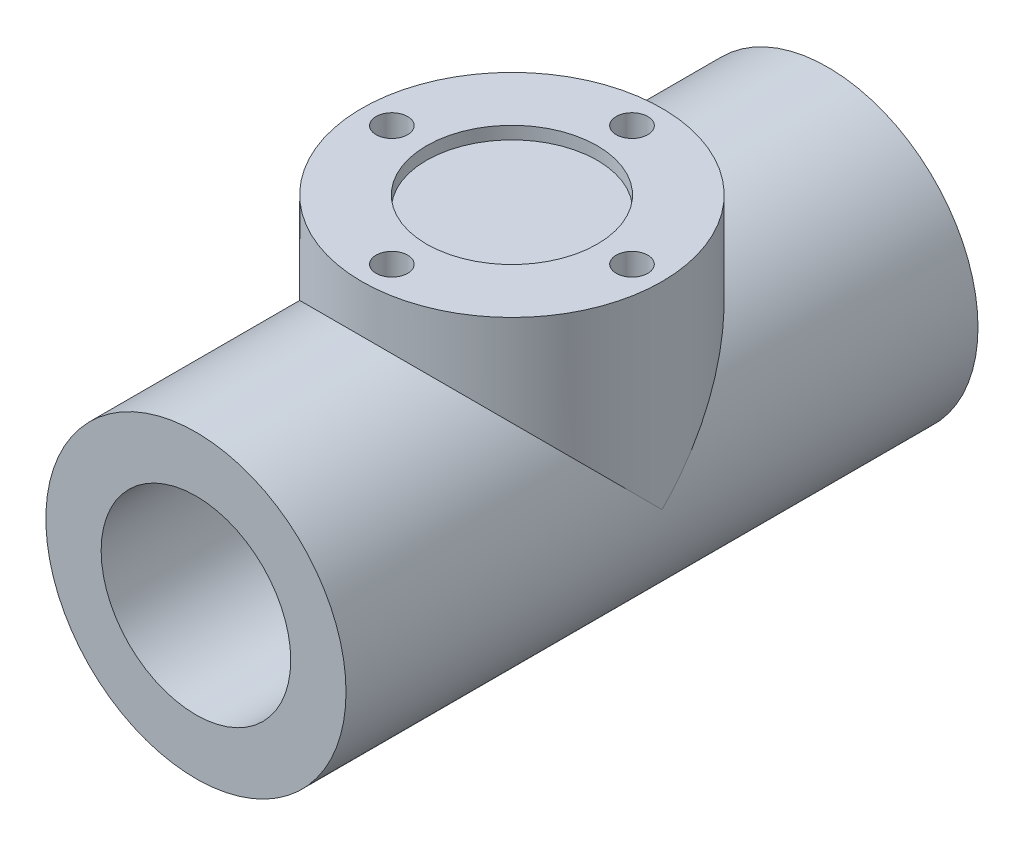
ISO-10303-21;
HEADER;
FILE_DESCRIPTION(('STEP AP214'),'2;1');
FILE_NAME('part.step','',(''),(''),'','','');
FILE_SCHEMA(('AUTOMOTIVE_DESIGN { 1 0 10303 214 1 1 1 1 }'));
ENDSEC;
DATA;
#1=APPLICATION_CONTEXT('core data for automotive mechanical design processes');
#2=APPLICATION_PROTOCOL_DEFINITION('international standard','automotive_design',2000,#1);
#3=PRODUCT_CONTEXT('',#1,'mechanical');
#4=PRODUCT('Part','Part','',(#3));
#5=PRODUCT_RELATED_PRODUCT_CATEGORY('part','',(#4));
#6=PRODUCT_DEFINITION_FORMATION('','',#4);
#7=PRODUCT_DEFINITION_CONTEXT('part definition',#1,'design');
#8=PRODUCT_DEFINITION('design','',#6,#7);
#9=PRODUCT_DEFINITION_SHAPE('','',#8);
#10=(LENGTH_UNIT() NAMED_UNIT(*) SI_UNIT(.MILLI.,.METRE.));
#11=(NAMED_UNIT(*) PLANE_ANGLE_UNIT() SI_UNIT($,.RADIAN.));
#12=(NAMED_UNIT(*) SI_UNIT($,.STERADIAN.) SOLID_ANGLE_UNIT());
#13=UNCERTAINTY_MEASURE_WITH_UNIT(LENGTH_MEASURE(1.E-05),#10,'distance_accuracy_value','');
#14=(GEOMETRIC_REPRESENTATION_CONTEXT(3) GLOBAL_UNCERTAINTY_ASSIGNED_CONTEXT((#13)) GLOBAL_UNIT_ASSIGNED_CONTEXT((#10,
#11,#12)) REPRESENTATION_CONTEXT('',''));
#15=CARTESIAN_POINT('',(0.,0.,0.));
#16=DIRECTION('',(0.,0.,1.));
#17=DIRECTION('',(1.,0.,0.));
#18=AXIS2_PLACEMENT_3D('',#15,#16,#17);
#19=CARTESIAN_POINT('',(0.,0.,100.));
#20=DIRECTION('',(0.,0.,-1.));
#21=DIRECTION('',(-1.,0.,0.));
#22=AXIS2_PLACEMENT_3D('',#19,#20,#21);
#23=CYLINDRICAL_SURFACE('',#22,47.5);
#24=CARTESIAN_POINT('',(0.,0.,-100.));
#25=DIRECTION('',(0.,0.,1.));
#26=DIRECTION('',(1.,0.,0.));
#27=AXIS2_PLACEMENT_3D('',#24,#25,#26);
#28=CIRCLE('',#27,47.5);
#29=CARTESIAN_POINT('',(47.5,0.,-100.));
#30=VERTEX_POINT('',#29);
#31=EDGE_CURVE('E53',#30,#30,#28,.T.);
#32=ORIENTED_EDGE('',*,*,#31,.T.);
#33=EDGE_LOOP('',(#32));
#34=FACE_BOUND('',#33,.T.);
#35=CARTESIAN_POINT('',(0.,0.,100.));
#36=DIRECTION('',(0.,0.,1.));
#37=DIRECTION('',(1.,0.,0.));
#38=AXIS2_PLACEMENT_3D('',#35,#36,#37);
#39=CIRCLE('',#38,47.5);
#40=CARTESIAN_POINT('',(47.5,0.,100.));
#41=VERTEX_POINT('',#40);
#42=EDGE_CURVE('E51',#41,#41,#39,.T.);
#43=ORIENTED_EDGE('',*,*,#42,.F.);
#44=EDGE_LOOP('',(#43));
#45=FACE_BOUND('',#44,.T.);
#46=CARTESIAN_POINT('',(0.,0.,0.));
#47=DIRECTION('',(0.,-0.707106781186547,-0.707106781186547));
#48=DIRECTION('',(0.,0.707106781186547,-0.707106781186547));
#49=AXIS2_PLACEMENT_3D('',#46,#47,#48);
#50=ELLIPSE('',#49,67.175144212722,47.5);
#51=CARTESIAN_POINT('',(47.5,0.,0.));
#52=VERTEX_POINT('',#51);
#53=CARTESIAN_POINT('',(-47.5,0.,0.));
#54=VERTEX_POINT('',#53);
#55=EDGE_CURVE('E11',#52,#54,#50,.F.);
#56=ORIENTED_EDGE('',*,*,#55,.F.);
#57=CARTESIAN_POINT('',(0.,0.,0.));
#58=DIRECTION('',(0.,0.707106781186547,-0.707106781186547));
#59=DIRECTION('',(0.,-0.707106781186547,-0.707106781186547));
#60=AXIS2_PLACEMENT_3D('',#57,#58,#59);
#61=ELLIPSE('',#60,67.175144212722,47.5);
#62=EDGE_CURVE('E43',#54,#52,#61,.T.);
#63=ORIENTED_EDGE('',*,*,#62,.F.);
#64=EDGE_LOOP('',(#56,#63));
#65=FACE_BOUND('',#64,.T.);
#66=ADVANCED_FACE('F36',(#34,#45,#65),#23,.T.);
#67=CARTESIAN_POINT('',(0.,0.,100.));
#68=DIRECTION('',(0.,0.,1.));
#69=DIRECTION('',(1.,0.,0.));
#70=AXIS2_PLACEMENT_3D('',#67,#68,#69);
#71=PLANE('',#70);
#72=CARTESIAN_POINT('',(0.,0.,100.));
#73=DIRECTION('',(0.,0.,1.));
#74=DIRECTION('',(1.,0.,0.));
#75=AXIS2_PLACEMENT_3D('',#72,#73,#74);
#76=CIRCLE('',#75,30.);
#77=CARTESIAN_POINT('',(30.,0.,100.));
#78=VERTEX_POINT('',#77);
#79=EDGE_CURVE('E91',#78,#78,#76,.F.);
#80=ORIENTED_EDGE('',*,*,#79,.T.);
#81=EDGE_LOOP('',(#80));
#82=FACE_BOUND('',#81,.T.);
#83=ORIENTED_EDGE('',*,*,#42,.T.);
#84=EDGE_LOOP('',(#83));
#85=FACE_BOUND('',#84,.T.);
#86=ADVANCED_FACE('F104',(#82,#85),#71,.T.);
#87=CARTESIAN_POINT('',(0.,0.,-100.));
#88=DIRECTION('',(0.,0.,1.));
#89=DIRECTION('',(1.,0.,0.));
#90=AXIS2_PLACEMENT_3D('',#87,#88,#89);
#91=PLANE('',#90);
#92=CARTESIAN_POINT('',(0.,0.,-100.));
#93=DIRECTION('',(0.,0.,-1.));
#94=DIRECTION('',(-1.,0.,0.));
#95=AXIS2_PLACEMENT_3D('',#92,#93,#94);
#96=CIRCLE('',#95,30.);
#97=CARTESIAN_POINT('',(-30.,0.,-100.));
#98=VERTEX_POINT('',#97);
#99=EDGE_CURVE('E94',#98,#98,#96,.T.);
#100=ORIENTED_EDGE('',*,*,#99,.F.);
#101=EDGE_LOOP('',(#100));
#102=FACE_BOUND('',#101,.T.);
#103=ORIENTED_EDGE('',*,*,#31,.F.);
#104=EDGE_LOOP('',(#103));
#105=FACE_BOUND('',#104,.T.);
#106=ADVANCED_FACE('F101',(#102,#105),#91,.F.);
#107=CARTESIAN_POINT('',(0.,62.5,0.));
#108=DIRECTION('',(0.,-1.,0.));
#109=DIRECTION('',(0.,0.,-1.));
#110=AXIS2_PLACEMENT_3D('',#107,#108,#109);
#111=CYLINDRICAL_SURFACE('',#110,47.5);
#112=CARTESIAN_POINT('',(0.,62.5,0.));
#113=DIRECTION('',(0.,1.,0.));
#114=DIRECTION('',(0.,0.,1.));
#115=AXIS2_PLACEMENT_3D('',#112,#113,#114);
#116=CIRCLE('',#115,47.5);
#117=CARTESIAN_POINT('',(0.,62.5,47.5));
#118=VERTEX_POINT('',#117);
#119=EDGE_CURVE('E57',#118,#118,#116,.T.);
#120=ORIENTED_EDGE('',*,*,#119,.F.);
#121=EDGE_LOOP('',(#120));
#122=FACE_BOUND('',#121,.T.);
#123=ORIENTED_EDGE('',*,*,#62,.T.);
#124=ORIENTED_EDGE('',*,*,#55,.T.);
#125=EDGE_LOOP('',(#123,#124));
#126=FACE_BOUND('',#125,.T.);
#127=ADVANCED_FACE('F50',(#122,#126),#111,.T.);
#128=CARTESIAN_POINT('',(0.,62.5,0.));
#129=DIRECTION('',(0.,1.,0.));
#130=DIRECTION('',(0.,0.,1.));
#131=AXIS2_PLACEMENT_3D('',#128,#129,#130);
#132=PLANE('',#131);
#133=CARTESIAN_POINT('',(38.,62.5,0.));
#134=DIRECTION('',(0.,1.,0.));
#135=DIRECTION('',(0.,0.,1.));
#136=AXIS2_PLACEMENT_3D('',#133,#134,#135);
#137=CIRCLE('',#136,5.00000000000001);
#138=CARTESIAN_POINT('',(38.,62.5,5.00000000000001));
#139=VERTEX_POINT('',#138);
#140=EDGE_CURVE('E88',#139,#139,#137,.T.);
#141=ORIENTED_EDGE('',*,*,#140,.F.);
#142=EDGE_LOOP('',(#141));
#143=FACE_BOUND('',#142,.T.);
#144=CARTESIAN_POINT('',(0.,62.5,-38.));
#145=DIRECTION('',(0.,1.,0.));
#146=DIRECTION('',(0.,0.,1.));
#147=AXIS2_PLACEMENT_3D('',#144,#145,#146);
#148=CIRCLE('',#147,5.00000000000001);
#149=CARTESIAN_POINT('',(0.,62.5,-33.));
#150=VERTEX_POINT('',#149);
#151=EDGE_CURVE('E82',#150,#150,#148,.T.);
#152=ORIENTED_EDGE('',*,*,#151,.F.);
#153=EDGE_LOOP('',(#152));
#154=FACE_BOUND('',#153,.T.);
#155=CARTESIAN_POINT('',(-38.,62.5,0.));
#156=DIRECTION('',(0.,1.,0.));
#157=DIRECTION('',(0.,0.,1.));
#158=AXIS2_PLACEMENT_3D('',#155,#156,#157);
#159=CIRCLE('',#158,5.00000000000001);
#160=CARTESIAN_POINT('',(-38.,62.5,5.00000000000001));
#161=VERTEX_POINT('',#160);
#162=EDGE_CURVE('E76',#161,#161,#159,.T.);
#163=ORIENTED_EDGE('',*,*,#162,.F.);
#164=EDGE_LOOP('',(#163));
#165=FACE_BOUND('',#164,.T.);
#166=CARTESIAN_POINT('',(0.,62.5,38.));
#167=DIRECTION('',(0.,1.,0.));
#168=DIRECTION('',(0.,0.,1.));
#169=AXIS2_PLACEMENT_3D('',#166,#167,#168);
#170=CIRCLE('',#169,5.00000000000001);
#171=CARTESIAN_POINT('',(0.,62.5,43.));
#172=VERTEX_POINT('',#171);
#173=EDGE_CURVE('E70',#172,#172,#170,.T.);
#174=ORIENTED_EDGE('',*,*,#173,.F.);
#175=EDGE_LOOP('',(#174));
#176=FACE_BOUND('',#175,.T.);
#177=CARTESIAN_POINT('',(0.,62.5,0.));
#178=DIRECTION('',(0.,1.,0.));
#179=DIRECTION('',(0.,0.,1.));
#180=AXIS2_PLACEMENT_3D('',#177,#178,#179);
#181=CIRCLE('',#180,27.);
#182=CARTESIAN_POINT('',(0.,62.5,27.));
#183=VERTEX_POINT('',#182);
#184=EDGE_CURVE('E62',#183,#183,#181,.T.);
#185=ORIENTED_EDGE('',*,*,#184,.F.);
#186=EDGE_LOOP('',(#185));
#187=FACE_BOUND('',#186,.T.);
#188=ORIENTED_EDGE('',*,*,#119,.T.);
#189=EDGE_LOOP('',(#188));
#190=FACE_BOUND('',#189,.T.);
#191=ADVANCED_FACE('F119',(#143,#154,#165,#176,#187,#190),#132,.T.);
#192=CARTESIAN_POINT('',(0.,58.5,0.));
#193=DIRECTION('',(0.,1.,0.));
#194=DIRECTION('',(0.,0.,1.));
#195=AXIS2_PLACEMENT_3D('',#192,#193,#194);
#196=CYLINDRICAL_SURFACE('',#195,27.);
#197=CARTESIAN_POINT('',(0.,58.5,0.));
#198=DIRECTION('',(0.,1.,0.));
#199=DIRECTION('',(0.,0.,1.));
#200=AXIS2_PLACEMENT_3D('',#197,#198,#199);
#201=CIRCLE('',#200,27.);
#202=CARTESIAN_POINT('',(0.,58.5,27.));
#203=VERTEX_POINT('',#202);
#204=EDGE_CURVE('E61',#203,#203,#201,.T.);
#205=ORIENTED_EDGE('',*,*,#204,.F.);
#206=EDGE_LOOP('',(#205));
#207=FACE_BOUND('',#206,.T.);
#208=ORIENTED_EDGE('',*,*,#184,.T.);
#209=EDGE_LOOP('',(#208));
#210=FACE_BOUND('',#209,.T.);
#211=ADVANCED_FACE('F123',(#207,#210),#196,.F.);
#212=CARTESIAN_POINT('',(0.,58.5,0.));
#213=DIRECTION('',(0.,1.,0.));
#214=DIRECTION('',(0.,0.,1.));
#215=AXIS2_PLACEMENT_3D('',#212,#213,#214);
#216=PLANE('',#215);
#217=ORIENTED_EDGE('',*,*,#204,.T.);
#218=EDGE_LOOP('',(#217));
#219=FACE_BOUND('',#218,.T.);
#220=ADVANCED_FACE('F127',(#219),#216,.T.);
#221=CARTESIAN_POINT('',(0.,42.5,38.));
#222=DIRECTION('',(0.,-1.,0.));
#223=DIRECTION('',(0.,0.,-1.));
#224=AXIS2_PLACEMENT_3D('',#221,#222,#223);
#225=PLANE('',#224);
#226=CARTESIAN_POINT('',(0.,42.5,38.));
#227=DIRECTION('',(0.,1.,0.));
#228=DIRECTION('',(0.,0.,1.));
#229=AXIS2_PLACEMENT_3D('',#226,#227,#228);
#230=CIRCLE('',#229,5.00000000000001);
#231=CARTESIAN_POINT('',(0.,42.5,43.));
#232=VERTEX_POINT('',#231);
#233=EDGE_CURVE('E65',#232,#232,#230,.T.);
#234=ORIENTED_EDGE('',*,*,#233,.T.);
#235=EDGE_LOOP('',(#234));
#236=FACE_BOUND('',#235,.T.);
#237=ADVANCED_FACE('F131',(#236),#225,.F.);
#238=CARTESIAN_POINT('',(0.,62.5,38.));
#239=DIRECTION('',(0.,1.,0.));
#240=DIRECTION('',(0.,0.,1.));
#241=AXIS2_PLACEMENT_3D('',#238,#239,#240);
#242=CYLINDRICAL_SURFACE('',#241,5.00000000000001);
#243=ORIENTED_EDGE('',*,*,#233,.F.);
#244=EDGE_LOOP('',(#243));
#245=FACE_BOUND('',#244,.T.);
#246=ORIENTED_EDGE('',*,*,#173,.T.);
#247=EDGE_LOOP('',(#246));
#248=FACE_BOUND('',#247,.T.);
#249=ADVANCED_FACE('F135',(#245,#248),#242,.F.);
#250=CARTESIAN_POINT('',(-38.,42.5,0.));
#251=DIRECTION('',(0.,-1.,0.));
#252=DIRECTION('',(0.,0.,-1.));
#253=AXIS2_PLACEMENT_3D('',#250,#251,#252);
#254=PLANE('',#253);
#255=CARTESIAN_POINT('',(-38.,42.5,0.));
#256=DIRECTION('',(0.,1.,0.));
#257=DIRECTION('',(0.,0.,1.));
#258=AXIS2_PLACEMENT_3D('',#255,#256,#257);
#259=CIRCLE('',#258,5.00000000000001);
#260=CARTESIAN_POINT('',(-38.,42.5,5.00000000000001));
#261=VERTEX_POINT('',#260);
#262=EDGE_CURVE('E73',#261,#261,#259,.T.);
#263=ORIENTED_EDGE('',*,*,#262,.T.);
#264=EDGE_LOOP('',(#263));
#265=FACE_BOUND('',#264,.T.);
#266=ADVANCED_FACE('F139',(#265),#254,.F.);
#267=CARTESIAN_POINT('',(-38.,62.5,0.));
#268=DIRECTION('',(0.,1.,0.));
#269=DIRECTION('',(0.,0.,1.));
#270=AXIS2_PLACEMENT_3D('',#267,#268,#269);
#271=CYLINDRICAL_SURFACE('',#270,5.00000000000001);
#272=ORIENTED_EDGE('',*,*,#262,.F.);
#273=EDGE_LOOP('',(#272));
#274=FACE_BOUND('',#273,.T.);
#275=ORIENTED_EDGE('',*,*,#162,.T.);
#276=EDGE_LOOP('',(#275));
#277=FACE_BOUND('',#276,.T.);
#278=ADVANCED_FACE('F143',(#274,#277),#271,.F.);
#279=CARTESIAN_POINT('',(0.,42.5,-38.));
#280=DIRECTION('',(0.,-1.,0.));
#281=DIRECTION('',(0.,0.,-1.));
#282=AXIS2_PLACEMENT_3D('',#279,#280,#281);
#283=PLANE('',#282);
#284=CARTESIAN_POINT('',(0.,42.5,-38.));
#285=DIRECTION('',(0.,1.,0.));
#286=DIRECTION('',(0.,0.,1.));
#287=AXIS2_PLACEMENT_3D('',#284,#285,#286);
#288=CIRCLE('',#287,5.00000000000001);
#289=CARTESIAN_POINT('',(0.,42.5,-33.));
#290=VERTEX_POINT('',#289);
#291=EDGE_CURVE('E79',#290,#290,#288,.T.);
#292=ORIENTED_EDGE('',*,*,#291,.T.);
#293=EDGE_LOOP('',(#292));
#294=FACE_BOUND('',#293,.T.);
#295=ADVANCED_FACE('F147',(#294),#283,.F.);
#296=CARTESIAN_POINT('',(0.,62.5,-38.));
#297=DIRECTION('',(0.,1.,0.));
#298=DIRECTION('',(0.,0.,1.));
#299=AXIS2_PLACEMENT_3D('',#296,#297,#298);
#300=CYLINDRICAL_SURFACE('',#299,5.00000000000001);
#301=ORIENTED_EDGE('',*,*,#291,.F.);
#302=EDGE_LOOP('',(#301));
#303=FACE_BOUND('',#302,.T.);
#304=ORIENTED_EDGE('',*,*,#151,.T.);
#305=EDGE_LOOP('',(#304));
#306=FACE_BOUND('',#305,.T.);
#307=ADVANCED_FACE('F151',(#303,#306),#300,.F.);
#308=CARTESIAN_POINT('',(38.,42.5,0.));
#309=DIRECTION('',(0.,-1.,0.));
#310=DIRECTION('',(0.,0.,-1.));
#311=AXIS2_PLACEMENT_3D('',#308,#309,#310);
#312=PLANE('',#311);
#313=CARTESIAN_POINT('',(38.,42.5,0.));
#314=DIRECTION('',(0.,1.,0.));
#315=DIRECTION('',(0.,0.,1.));
#316=AXIS2_PLACEMENT_3D('',#313,#314,#315);
#317=CIRCLE('',#316,5.00000000000001);
#318=CARTESIAN_POINT('',(38.,42.5,5.00000000000001));
#319=VERTEX_POINT('',#318);
#320=EDGE_CURVE('E85',#319,#319,#317,.T.);
#321=ORIENTED_EDGE('',*,*,#320,.T.);
#322=EDGE_LOOP('',(#321));
#323=FACE_BOUND('',#322,.T.);
#324=ADVANCED_FACE('F155',(#323),#312,.F.);
#325=CARTESIAN_POINT('',(38.,62.5,0.));
#326=DIRECTION('',(0.,1.,0.));
#327=DIRECTION('',(0.,0.,1.));
#328=AXIS2_PLACEMENT_3D('',#325,#326,#327);
#329=CYLINDRICAL_SURFACE('',#328,5.00000000000001);
#330=ORIENTED_EDGE('',*,*,#320,.F.);
#331=EDGE_LOOP('',(#330));
#332=FACE_BOUND('',#331,.T.);
#333=ORIENTED_EDGE('',*,*,#140,.T.);
#334=EDGE_LOOP('',(#333));
#335=FACE_BOUND('',#334,.T.);
#336=ADVANCED_FACE('F159',(#332,#335),#329,.F.);
#337=CARTESIAN_POINT('',(0.,0.,184.852813742386));
#338=DIRECTION('',(0.,0.,-1.));
#339=DIRECTION('',(-1.,0.,0.));
#340=AXIS2_PLACEMENT_3D('',#337,#338,#339);
#341=CYLINDRICAL_SURFACE('',#340,30.);
#342=ORIENTED_EDGE('',*,*,#99,.T.);
#343=EDGE_LOOP('',(#342));
#344=FACE_BOUND('',#343,.T.);
#345=ORIENTED_EDGE('',*,*,#79,.F.);
#346=EDGE_LOOP('',(#345));
#347=FACE_BOUND('',#346,.T.);
#348=ADVANCED_FACE('F98',(#344,#347),#341,.F.);
#349=CLOSED_SHELL('',(#66,#86,#106,#127,#191,#211,#220,#237,#249,#266,#278,#295,#307,#324,#336,#348));
#350=MANIFOLD_SOLID_BREP('B2',#349);
#351=ADVANCED_BREP_SHAPE_REPRESENTATION('',(#18,#350),#14);
#352=SHAPE_DEFINITION_REPRESENTATION(#9,#351);
ENDSEC;
END-ISO-10303-21;
